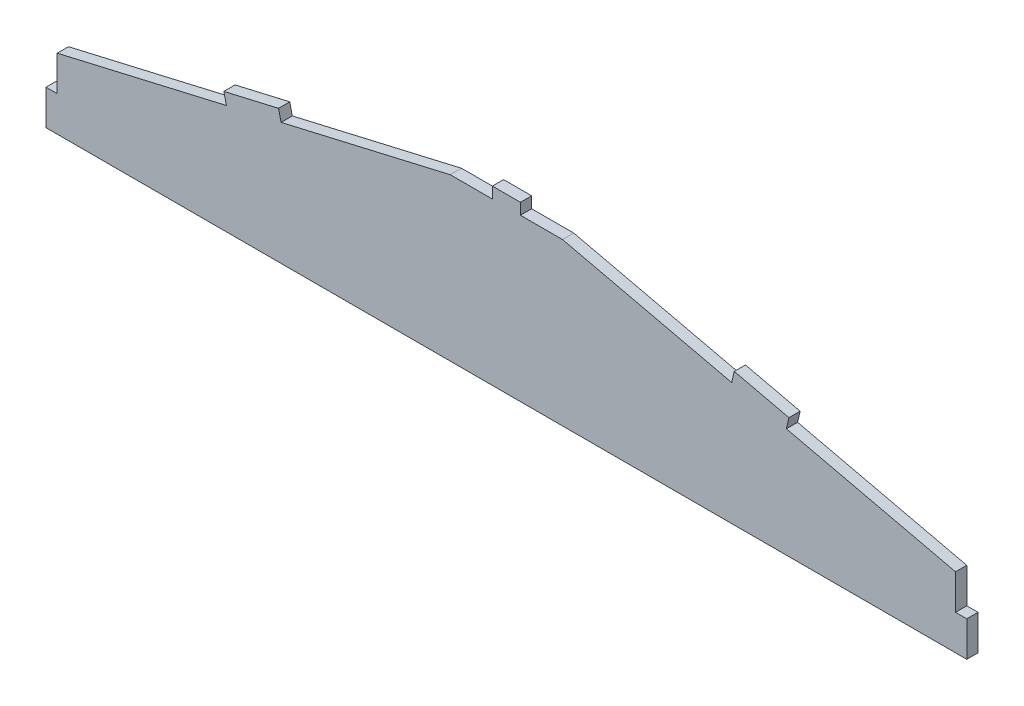
ISO-10303-21;
HEADER;
FILE_DESCRIPTION(('STEP AP214'),'2;1');
FILE_NAME('part.step','',(''),(''),'','','');
FILE_SCHEMA(('AUTOMOTIVE_DESIGN { 1 0 10303 214 1 1 1 1 }'));
ENDSEC;
DATA;
#1=APPLICATION_CONTEXT('core data for automotive mechanical design processes');
#2=APPLICATION_PROTOCOL_DEFINITION('international standard','automotive_design',2000,#1);
#3=PRODUCT_CONTEXT('',#1,'mechanical');
#4=PRODUCT('Part','Part','',(#3));
#5=PRODUCT_RELATED_PRODUCT_CATEGORY('part','',(#4));
#6=PRODUCT_DEFINITION_FORMATION('','',#4);
#7=PRODUCT_DEFINITION_CONTEXT('part definition',#1,'design');
#8=PRODUCT_DEFINITION('design','',#6,#7);
#9=PRODUCT_DEFINITION_SHAPE('','',#8);
#10=(LENGTH_UNIT() NAMED_UNIT(*) SI_UNIT(.MILLI.,.METRE.));
#11=(NAMED_UNIT(*) PLANE_ANGLE_UNIT() SI_UNIT($,.RADIAN.));
#12=(NAMED_UNIT(*) SI_UNIT($,.STERADIAN.) SOLID_ANGLE_UNIT());
#13=UNCERTAINTY_MEASURE_WITH_UNIT(LENGTH_MEASURE(1.E-05),#10,'distance_accuracy_value','');
#14=(GEOMETRIC_REPRESENTATION_CONTEXT(3) GLOBAL_UNCERTAINTY_ASSIGNED_CONTEXT((#13)) GLOBAL_UNIT_ASSIGNED_CONTEXT((#10,
#11,#12)) REPRESENTATION_CONTEXT('',''));
#15=CARTESIAN_POINT('',(0.,0.,0.));
#16=DIRECTION('',(0.,0.,1.));
#17=DIRECTION('',(1.,0.,0.));
#18=AXIS2_PLACEMENT_3D('',#15,#16,#17);
#19=CARTESIAN_POINT('',(203.2,31.75,5.08));
#20=DIRECTION('',(0.22612970719935,0.974097200243352,0.));
#21=DIRECTION('',(-0.974097200243352,0.22612970719935,0.));
#22=AXIS2_PLACEMENT_3D('',#19,#20,#21);
#23=PLANE('',#22);
#24=DIRECTION('',(0.,0.,1.));
#25=VECTOR('',#24,1.);
#26=CARTESIAN_POINT('',(126.671034443091,49.5156527185682,0.));
#27=LINE('',#26,#25);
#28=CARTESIAN_POINT('',(126.671034443091,49.5156527185682,0.));
#29=VERTEX_POINT('',#28);
#30=CARTESIAN_POINT('',(126.671034443091,49.5156527185682,5.08));
#31=VERTEX_POINT('',#30);
#32=EDGE_CURVE('E206',#29,#31,#27,.T.);
#33=ORIENTED_EDGE('',*,*,#32,.T.);
#34=DIRECTION('',(0.974097200243352,-0.22612970719935,0.));
#35=VECTOR('',#34,1.);
#36=CARTESIAN_POINT('',(203.2,31.75,5.08));
#37=LINE('',#36,#35);
#38=CARTESIAN_POINT('',(203.2,31.75,5.08));
#39=VERTEX_POINT('',#38);
#40=EDGE_CURVE('E316',#31,#39,#37,.T.);
#41=ORIENTED_EDGE('',*,*,#40,.T.);
#42=DIRECTION('',(0.,0.,-1.));
#43=VECTOR('',#42,1.);
#44=CARTESIAN_POINT('',(203.2,31.75,5.08));
#45=LINE('',#44,#43);
#46=CARTESIAN_POINT('',(203.2,31.75,0.));
#47=VERTEX_POINT('',#46);
#48=EDGE_CURVE('E325',#39,#47,#45,.T.);
#49=ORIENTED_EDGE('',*,*,#48,.T.);
#50=DIRECTION('',(0.974097200243352,-0.22612970719935,0.));
#51=VECTOR('',#50,1.);
#52=CARTESIAN_POINT('',(203.2,31.75,0.));
#53=LINE('',#52,#51);
#54=EDGE_CURVE('E56',#29,#47,#53,.T.);
#55=ORIENTED_EDGE('',*,*,#54,.F.);
#56=EDGE_LOOP('',(#33,#41,#49,#55));
#57=FACE_BOUND('',#56,.T.);
#58=ADVANCED_FACE('F33',(#57),#23,.T.);
#59=CARTESIAN_POINT('',(-25.4,73.025,5.08));
#60=DIRECTION('',(0.,-1.,0.));
#61=DIRECTION('',(0.,0.,-1.));
#62=AXIS2_PLACEMENT_3D('',#59,#60,#61);
#63=PLANE('',#62);
#64=DIRECTION('',(0.,0.,1.));
#65=VECTOR('',#64,1.);
#66=CARTESIAN_POINT('',(-6.35,73.025,0.));
#67=LINE('',#66,#65);
#68=CARTESIAN_POINT('',(-6.35,73.025,0.));
#69=VERTEX_POINT('',#68);
#70=CARTESIAN_POINT('',(-6.35,73.025,5.08));
#71=VERTEX_POINT('',#70);
#72=EDGE_CURVE('E250',#69,#71,#67,.T.);
#73=ORIENTED_EDGE('',*,*,#72,.F.);
#74=DIRECTION('',(-1.,0.,0.));
#75=VECTOR('',#74,1.);
#76=CARTESIAN_POINT('',(-25.4,73.025,0.));
#77=LINE('',#76,#75);
#78=CARTESIAN_POINT('',(-25.4,73.025,0.));
#79=VERTEX_POINT('',#78);
#80=EDGE_CURVE('E343',#69,#79,#77,.T.);
#81=ORIENTED_EDGE('',*,*,#80,.T.);
#82=DIRECTION('',(0.,0.,-1.));
#83=VECTOR('',#82,1.);
#84=CARTESIAN_POINT('',(-25.4,73.025,5.08));
#85=LINE('',#84,#83);
#86=CARTESIAN_POINT('',(-25.4,73.025,5.08));
#87=VERTEX_POINT('',#86);
#88=EDGE_CURVE('E11',#87,#79,#85,.T.);
#89=ORIENTED_EDGE('',*,*,#88,.F.);
#90=DIRECTION('',(-1.,0.,0.));
#91=VECTOR('',#90,1.);
#92=CARTESIAN_POINT('',(-25.4,73.025,5.08));
#93=LINE('',#92,#91);
#94=EDGE_CURVE('E330',#71,#87,#93,.T.);
#95=ORIENTED_EDGE('',*,*,#94,.F.);
#96=EDGE_LOOP('',(#73,#81,#89,#95));
#97=FACE_BOUND('',#96,.T.);
#98=ADVANCED_FACE('F390',(#97),#63,.F.);
#99=CARTESIAN_POINT('',(-203.2,31.75,5.08));
#100=DIRECTION('',(0.22612970719935,-0.974097200243352,0.));
#101=DIRECTION('',(0.974097200243352,0.22612970719935,0.));
#102=AXIS2_PLACEMENT_3D('',#99,#100,#101);
#103=PLANE('',#102);
#104=DIRECTION('',(-0.974097200243352,-0.22612970719935,0.));
#105=VECTOR('',#104,1.);
#106=CARTESIAN_POINT('',(-203.2,31.75,5.08));
#107=LINE('',#106,#105);
#108=CARTESIAN_POINT('',(-126.671034443091,49.5156527185683,5.08));
#109=VERTEX_POINT('',#108);
#110=CARTESIAN_POINT('',(-203.2,31.75,5.08));
#111=VERTEX_POINT('',#110);
#112=EDGE_CURVE('E335',#109,#111,#107,.T.);
#113=ORIENTED_EDGE('',*,*,#112,.F.);
#114=DIRECTION('',(0.,0.,1.));
#115=VECTOR('',#114,1.);
#116=CARTESIAN_POINT('',(-126.671034443091,49.5156527185683,0.));
#117=LINE('',#116,#115);
#118=CARTESIAN_POINT('',(-126.671034443091,49.5156527185683,0.));
#119=VERTEX_POINT('',#118);
#120=EDGE_CURVE('E297',#119,#109,#117,.T.);
#121=ORIENTED_EDGE('',*,*,#120,.F.);
#122=DIRECTION('',(-0.974097200243352,-0.22612970719935,0.));
#123=VECTOR('',#122,1.);
#124=CARTESIAN_POINT('',(-203.2,31.75,0.));
#125=LINE('',#124,#123);
#126=CARTESIAN_POINT('',(-203.2,31.75,0.));
#127=VERTEX_POINT('',#126);
#128=EDGE_CURVE('E347',#119,#127,#125,.T.);
#129=ORIENTED_EDGE('',*,*,#128,.T.);
#130=DIRECTION('',(0.,0.,-1.));
#131=VECTOR('',#130,1.);
#132=CARTESIAN_POINT('',(-203.2,31.75,5.08));
#133=LINE('',#132,#131);
#134=EDGE_CURVE('E41',#111,#127,#133,.T.);
#135=ORIENTED_EDGE('',*,*,#134,.F.);
#136=EDGE_LOOP('',(#113,#121,#129,#135));
#137=FACE_BOUND('',#136,.T.);
#138=ADVANCED_FACE('F368',(#137),#103,.F.);
#139=CARTESIAN_POINT('',(0.,0.,5.08));
#140=DIRECTION('',(0.,1.,0.));
#141=DIRECTION('',(-1.,0.,0.));
#142=AXIS2_PLACEMENT_3D('',#139,#140,#141);
#143=PLANE('',#142);
#144=DIRECTION('',(1.,0.,0.));
#145=VECTOR('',#144,1.);
#146=CARTESIAN_POINT('',(0.,0.,0.));
#147=LINE('',#146,#145);
#148=CARTESIAN_POINT('',(-208.28,0.,0.));
#149=VERTEX_POINT('',#148);
#150=CARTESIAN_POINT('',(208.28,0.,0.));
#151=VERTEX_POINT('',#150);
#152=EDGE_CURVE('E327',#149,#151,#147,.T.);
#153=ORIENTED_EDGE('',*,*,#152,.T.);
#154=DIRECTION('',(0.,0.,1.));
#155=VECTOR('',#154,1.);
#156=CARTESIAN_POINT('',(208.28,0.,0.));
#157=LINE('',#156,#155);
#158=CARTESIAN_POINT('',(208.28,0.,5.08));
#159=VERTEX_POINT('',#158);
#160=EDGE_CURVE('E228',#151,#159,#157,.T.);
#161=ORIENTED_EDGE('',*,*,#160,.T.);
#162=DIRECTION('',(1.,0.,0.));
#163=VECTOR('',#162,1.);
#164=CARTESIAN_POINT('',(0.,0.,5.08));
#165=LINE('',#164,#163);
#166=CARTESIAN_POINT('',(-208.28,0.,5.08));
#167=VERTEX_POINT('',#166);
#168=EDGE_CURVE('E328',#167,#159,#165,.T.);
#169=ORIENTED_EDGE('',*,*,#168,.F.);
#170=DIRECTION('',(0.,0.,1.));
#171=VECTOR('',#170,1.);
#172=CARTESIAN_POINT('',(-208.28,0.,0.));
#173=LINE('',#172,#171);
#174=EDGE_CURVE('E279',#149,#167,#173,.T.);
#175=ORIENTED_EDGE('',*,*,#174,.F.);
#176=EDGE_LOOP('',(#153,#161,#169,#175));
#177=FACE_BOUND('',#176,.T.);
#178=ADVANCED_FACE('F35',(#177),#143,.F.);
#179=CARTESIAN_POINT('',(25.4,73.025,0.));
#180=VERTEX_POINT('',#179);
#181=CARTESIAN_POINT('',(6.35,73.025,0.));
#182=VERTEX_POINT('',#181);
#183=EDGE_CURVE('E344',#180,#182,#77,.T.);
#184=ORIENTED_EDGE('',*,*,#183,.T.);
#185=DIRECTION('',(0.,0.,1.));
#186=VECTOR('',#185,1.);
#187=CARTESIAN_POINT('',(6.35,73.025,0.));
#188=LINE('',#187,#186);
#189=CARTESIAN_POINT('',(6.35,73.025,5.08));
#190=VERTEX_POINT('',#189);
#191=EDGE_CURVE('E263',#182,#190,#188,.T.);
#192=ORIENTED_EDGE('',*,*,#191,.T.);
#193=CARTESIAN_POINT('',(25.4,73.025,5.08));
#194=VERTEX_POINT('',#193);
#195=EDGE_CURVE('E332',#194,#190,#93,.T.);
#196=ORIENTED_EDGE('',*,*,#195,.F.);
#197=DIRECTION('',(0.,0.,-1.));
#198=VECTOR('',#197,1.);
#199=CARTESIAN_POINT('',(25.4,73.025,5.08));
#200=LINE('',#199,#198);
#201=EDGE_CURVE('E319',#194,#180,#200,.T.);
#202=ORIENTED_EDGE('',*,*,#201,.T.);
#203=EDGE_LOOP('',(#184,#192,#196,#202));
#204=FACE_BOUND('',#203,.T.);
#205=ADVANCED_FACE('F401',(#204),#63,.F.);
#206=CARTESIAN_POINT('',(-101.928965556909,55.2593472814317,0.));
#207=VERTEX_POINT('',#206);
#208=EDGE_CURVE('E348',#79,#207,#125,.T.);
#209=ORIENTED_EDGE('',*,*,#208,.T.);
#210=DIRECTION('',(0.,0.,1.));
#211=VECTOR('',#210,1.);
#212=CARTESIAN_POINT('',(-101.928965556909,55.2593472814317,0.));
#213=LINE('',#212,#211);
#214=CARTESIAN_POINT('',(-101.928965556909,55.2593472814317,5.08));
#215=VERTEX_POINT('',#214);
#216=EDGE_CURVE('E310',#207,#215,#213,.T.);
#217=ORIENTED_EDGE('',*,*,#216,.T.);
#218=EDGE_CURVE('E336',#87,#215,#107,.T.);
#219=ORIENTED_EDGE('',*,*,#218,.F.);
#220=ORIENTED_EDGE('',*,*,#88,.T.);
#221=EDGE_LOOP('',(#209,#217,#219,#220));
#222=FACE_BOUND('',#221,.T.);
#223=ADVANCED_FACE('F384',(#222),#103,.F.);
#224=CARTESIAN_POINT('',(-203.2,0.,5.08));
#225=DIRECTION('',(1.,0.,0.));
#226=DIRECTION('',(0.,0.,-1.));
#227=AXIS2_PLACEMENT_3D('',#224,#225,#226);
#228=PLANE('',#227);
#229=DIRECTION('',(0.,-1.,0.));
#230=VECTOR('',#229,1.);
#231=CARTESIAN_POINT('',(-203.2,0.,0.));
#232=LINE('',#231,#230);
#233=CARTESIAN_POINT('',(-203.2,15.875,0.));
#234=VERTEX_POINT('',#233);
#235=EDGE_CURVE('E331',#127,#234,#232,.T.);
#236=ORIENTED_EDGE('',*,*,#235,.T.);
#237=DIRECTION('',(0.,0.,1.));
#238=VECTOR('',#237,1.);
#239=CARTESIAN_POINT('',(-203.2,15.875,0.));
#240=LINE('',#239,#238);
#241=CARTESIAN_POINT('',(-203.2,15.875,5.08));
#242=VERTEX_POINT('',#241);
#243=EDGE_CURVE('E274',#234,#242,#240,.T.);
#244=ORIENTED_EDGE('',*,*,#243,.T.);
#245=DIRECTION('',(0.,-1.,0.));
#246=VECTOR('',#245,1.);
#247=CARTESIAN_POINT('',(-203.2,0.,5.08));
#248=LINE('',#247,#246);
#249=EDGE_CURVE('E339',#111,#242,#248,.T.);
#250=ORIENTED_EDGE('',*,*,#249,.F.);
#251=ORIENTED_EDGE('',*,*,#134,.T.);
#252=EDGE_LOOP('',(#236,#244,#250,#251));
#253=FACE_BOUND('',#252,.T.);
#254=ADVANCED_FACE('F356',(#253),#228,.F.);
#255=CARTESIAN_POINT('',(0.,0.,5.08));
#256=DIRECTION('',(0.,0.,-1.));
#257=DIRECTION('',(-1.,0.,0.));
#258=AXIS2_PLACEMENT_3D('',#255,#256,#257);
#259=PLANE('',#258);
#260=ORIENTED_EDGE('',*,*,#168,.T.);
#261=DIRECTION('',(0.,1.,0.));
#262=VECTOR('',#261,1.);
#263=CARTESIAN_POINT('',(208.28,0.,5.08));
#264=LINE('',#263,#262);
#265=CARTESIAN_POINT('',(208.28,15.875,5.08));
#266=VERTEX_POINT('',#265);
#267=EDGE_CURVE('E217',#159,#266,#264,.T.);
#268=ORIENTED_EDGE('',*,*,#267,.T.);
#269=DIRECTION('',(-1.,0.,0.));
#270=VECTOR('',#269,1.);
#271=CARTESIAN_POINT('',(203.2,15.875,5.08));
#272=LINE('',#271,#270);
#273=CARTESIAN_POINT('',(203.2,15.875,5.08));
#274=VERTEX_POINT('',#273);
#275=EDGE_CURVE('E225',#266,#274,#272,.T.);
#276=ORIENTED_EDGE('',*,*,#275,.T.);
#277=DIRECTION('',(0.,-1.,0.));
#278=VECTOR('',#277,1.);
#279=CARTESIAN_POINT('',(203.2,0.,5.08));
#280=LINE('',#279,#278);
#281=EDGE_CURVE('E314',#39,#274,#280,.T.);
#282=ORIENTED_EDGE('',*,*,#281,.F.);
#283=ORIENTED_EDGE('',*,*,#40,.F.);
#284=DIRECTION('',(0.226129707199344,0.974097200243353,0.));
#285=VECTOR('',#284,1.);
#286=CARTESIAN_POINT('',(126.671034443091,49.5156527185682,5.08));
#287=LINE('',#286,#285);
#288=CARTESIAN_POINT('',(127.819773355663,54.4640664958045,5.08));
#289=VERTEX_POINT('',#288);
#290=EDGE_CURVE('E213',#31,#289,#287,.T.);
#291=ORIENTED_EDGE('',*,*,#290,.T.);
#292=DIRECTION('',(-0.974097200243352,0.22612970719935,0.));
#293=VECTOR('',#292,1.);
#294=CARTESIAN_POINT('',(127.819773355663,54.4640664958045,5.08));
#295=LINE('',#294,#293);
#296=CARTESIAN_POINT('',(103.077704469482,60.2077610586679,5.08));
#297=VERTEX_POINT('',#296);
#298=EDGE_CURVE('E189',#289,#297,#295,.T.);
#299=ORIENTED_EDGE('',*,*,#298,.T.);
#300=DIRECTION('',(-0.226129707199352,-0.974097200243351,0.));
#301=VECTOR('',#300,1.);
#302=CARTESIAN_POINT('',(101.928965556909,55.2593472814317,5.08));
#303=LINE('',#302,#301);
#304=CARTESIAN_POINT('',(101.928965556909,55.2593472814317,5.08));
#305=VERTEX_POINT('',#304);
#306=EDGE_CURVE('E207',#297,#305,#303,.T.);
#307=ORIENTED_EDGE('',*,*,#306,.T.);
#308=EDGE_CURVE('E48',#194,#305,#37,.T.);
#309=ORIENTED_EDGE('',*,*,#308,.F.);
#310=ORIENTED_EDGE('',*,*,#195,.T.);
#311=DIRECTION('',(0.,1.,0.));
#312=VECTOR('',#311,1.);
#313=CARTESIAN_POINT('',(6.35,73.025,5.08));
#314=LINE('',#313,#312);
#315=CARTESIAN_POINT('',(6.35,78.105,5.08));
#316=VERTEX_POINT('',#315);
#317=EDGE_CURVE('E253',#190,#316,#314,.T.);
#318=ORIENTED_EDGE('',*,*,#317,.T.);
#319=DIRECTION('',(-1.,0.,0.));
#320=VECTOR('',#319,1.);
#321=CARTESIAN_POINT('',(-6.35,78.105,5.08));
#322=LINE('',#321,#320);
#323=CARTESIAN_POINT('',(-6.35,78.105,5.08));
#324=VERTEX_POINT('',#323);
#325=EDGE_CURVE('E244',#316,#324,#322,.T.);
#326=ORIENTED_EDGE('',*,*,#325,.T.);
#327=DIRECTION('',(0.,-1.,0.));
#328=VECTOR('',#327,1.);
#329=CARTESIAN_POINT('',(-6.35,73.025,5.08));
#330=LINE('',#329,#328);
#331=EDGE_CURVE('E236',#324,#71,#330,.T.);
#332=ORIENTED_EDGE('',*,*,#331,.T.);
#333=ORIENTED_EDGE('',*,*,#94,.T.);
#334=ORIENTED_EDGE('',*,*,#218,.T.);
#335=DIRECTION('',(-0.226129707199347,0.974097200243352,0.));
#336=VECTOR('',#335,1.);
#337=CARTESIAN_POINT('',(-101.928965556909,55.2593472814317,5.08));
#338=LINE('',#337,#336);
#339=CARTESIAN_POINT('',(-103.077704469482,60.207761058668,5.08));
#340=VERTEX_POINT('',#339);
#341=EDGE_CURVE('E300',#215,#340,#338,.T.);
#342=ORIENTED_EDGE('',*,*,#341,.T.);
#343=DIRECTION('',(-0.974097200243352,-0.22612970719935,0.));
#344=VECTOR('',#343,1.);
#345=CARTESIAN_POINT('',(-127.819773355663,54.4640664958045,5.08));
#346=LINE('',#345,#344);
#347=CARTESIAN_POINT('',(-127.819773355663,54.4640664958045,5.08));
#348=VERTEX_POINT('',#347);
#349=EDGE_CURVE('E291',#340,#348,#346,.T.);
#350=ORIENTED_EDGE('',*,*,#349,.T.);
#351=DIRECTION('',(0.226129707199355,-0.97409720024335,0.));
#352=VECTOR('',#351,1.);
#353=CARTESIAN_POINT('',(-126.671034443091,49.5156527185683,5.08));
#354=LINE('',#353,#352);
#355=EDGE_CURVE('E282',#348,#109,#354,.T.);
#356=ORIENTED_EDGE('',*,*,#355,.T.);
#357=ORIENTED_EDGE('',*,*,#112,.T.);
#358=ORIENTED_EDGE('',*,*,#249,.T.);
#359=DIRECTION('',(-1.,0.,0.));
#360=VECTOR('',#359,1.);
#361=CARTESIAN_POINT('',(-203.2,15.875,5.08));
#362=LINE('',#361,#360);
#363=CARTESIAN_POINT('',(-208.28,15.875,5.08));
#364=VERTEX_POINT('',#363);
#365=EDGE_CURVE('E260',#242,#364,#362,.T.);
#366=ORIENTED_EDGE('',*,*,#365,.T.);
#367=DIRECTION('',(0.,-1.,0.));
#368=VECTOR('',#367,1.);
#369=CARTESIAN_POINT('',(-208.28,0.,5.08));
#370=LINE('',#369,#368);
#371=EDGE_CURVE('E271',#364,#167,#370,.T.);
#372=ORIENTED_EDGE('',*,*,#371,.T.);
#373=EDGE_LOOP('',(#260,#268,#276,#282,#283,#291,#299,#307,#309,#310,#318,#326,#332,#333,#334,
#342,#350,#356,#357,#358,#366,#372));
#374=FACE_BOUND('',#373,.T.);
#375=ADVANCED_FACE('F365',(#374),#259,.F.);
#376=CARTESIAN_POINT('',(0.,0.,0.));
#377=DIRECTION('',(0.,0.,-1.));
#378=DIRECTION('',(-1.,0.,0.));
#379=AXIS2_PLACEMENT_3D('',#376,#377,#378);
#380=PLANE('',#379);
#381=ORIENTED_EDGE('',*,*,#152,.F.);
#382=DIRECTION('',(0.,-1.,0.));
#383=VECTOR('',#382,1.);
#384=CARTESIAN_POINT('',(-208.28,0.,0.));
#385=LINE('',#384,#383);
#386=CARTESIAN_POINT('',(-208.28,15.875,0.));
#387=VERTEX_POINT('',#386);
#388=EDGE_CURVE('E270',#387,#149,#385,.T.);
#389=ORIENTED_EDGE('',*,*,#388,.F.);
#390=DIRECTION('',(-1.,0.,0.));
#391=VECTOR('',#390,1.);
#392=CARTESIAN_POINT('',(-203.2,15.875,0.));
#393=LINE('',#392,#391);
#394=EDGE_CURVE('E267',#234,#387,#393,.T.);
#395=ORIENTED_EDGE('',*,*,#394,.F.);
#396=ORIENTED_EDGE('',*,*,#235,.F.);
#397=ORIENTED_EDGE('',*,*,#128,.F.);
#398=DIRECTION('',(0.226129707199355,-0.97409720024335,0.));
#399=VECTOR('',#398,1.);
#400=CARTESIAN_POINT('',(-126.671034443091,49.5156527185683,0.));
#401=LINE('',#400,#399);
#402=CARTESIAN_POINT('',(-127.819773355663,54.4640664958045,0.));
#403=VERTEX_POINT('',#402);
#404=EDGE_CURVE('E287',#403,#119,#401,.T.);
#405=ORIENTED_EDGE('',*,*,#404,.F.);
#406=DIRECTION('',(-0.974097200243352,-0.22612970719935,0.));
#407=VECTOR('',#406,1.);
#408=CARTESIAN_POINT('',(-127.819773355663,54.4640664958045,0.));
#409=LINE('',#408,#407);
#410=CARTESIAN_POINT('',(-103.077704469482,60.207761058668,0.));
#411=VERTEX_POINT('',#410);
#412=EDGE_CURVE('E294',#411,#403,#409,.T.);
#413=ORIENTED_EDGE('',*,*,#412,.F.);
#414=DIRECTION('',(-0.226129707199347,0.974097200243352,0.));
#415=VECTOR('',#414,1.);
#416=CARTESIAN_POINT('',(-101.928965556909,55.2593472814317,0.));
#417=LINE('',#416,#415);
#418=EDGE_CURVE('E290',#207,#411,#417,.T.);
#419=ORIENTED_EDGE('',*,*,#418,.F.);
#420=ORIENTED_EDGE('',*,*,#208,.F.);
#421=ORIENTED_EDGE('',*,*,#80,.F.);
#422=DIRECTION('',(0.,-1.,0.));
#423=VECTOR('',#422,1.);
#424=CARTESIAN_POINT('',(-6.35,73.025,0.));
#425=LINE('',#424,#423);
#426=CARTESIAN_POINT('',(-6.35,78.105,0.));
#427=VERTEX_POINT('',#426);
#428=EDGE_CURVE('E241',#427,#69,#425,.T.);
#429=ORIENTED_EDGE('',*,*,#428,.F.);
#430=DIRECTION('',(-1.,0.,0.));
#431=VECTOR('',#430,1.);
#432=CARTESIAN_POINT('',(-6.35,78.105,0.));
#433=LINE('',#432,#431);
#434=CARTESIAN_POINT('',(6.35,78.105,0.));
#435=VERTEX_POINT('',#434);
#436=EDGE_CURVE('E247',#435,#427,#433,.T.);
#437=ORIENTED_EDGE('',*,*,#436,.F.);
#438=DIRECTION('',(0.,1.,0.));
#439=VECTOR('',#438,1.);
#440=CARTESIAN_POINT('',(6.35,73.025,0.));
#441=LINE('',#440,#439);
#442=EDGE_CURVE('E243',#182,#435,#441,.T.);
#443=ORIENTED_EDGE('',*,*,#442,.F.);
#444=ORIENTED_EDGE('',*,*,#183,.F.);
#445=CARTESIAN_POINT('',(101.928965556909,55.2593472814317,0.));
#446=VERTEX_POINT('',#445);
#447=EDGE_CURVE('E317',#180,#446,#53,.T.);
#448=ORIENTED_EDGE('',*,*,#447,.T.);
#449=DIRECTION('',(-0.226129707199352,-0.974097200243351,0.));
#450=VECTOR('',#449,1.);
#451=CARTESIAN_POINT('',(101.928965556909,55.2593472814317,0.));
#452=LINE('',#451,#450);
#453=CARTESIAN_POINT('',(103.077704469482,60.2077610586679,0.));
#454=VERTEX_POINT('',#453);
#455=EDGE_CURVE('E195',#454,#446,#452,.T.);
#456=ORIENTED_EDGE('',*,*,#455,.F.);
#457=DIRECTION('',(-0.974097200243352,0.22612970719935,0.));
#458=VECTOR('',#457,1.);
#459=CARTESIAN_POINT('',(127.819773355663,54.4640664958045,0.));
#460=LINE('',#459,#458);
#461=CARTESIAN_POINT('',(127.819773355663,54.4640664958045,0.));
#462=VERTEX_POINT('',#461);
#463=EDGE_CURVE('E187',#462,#454,#460,.T.);
#464=ORIENTED_EDGE('',*,*,#463,.F.);
#465=DIRECTION('',(0.226129707199344,0.974097200243353,0.));
#466=VECTOR('',#465,1.);
#467=CARTESIAN_POINT('',(126.671034443091,49.5156527185682,0.));
#468=LINE('',#467,#466);
#469=EDGE_CURVE('E201',#29,#462,#468,.T.);
#470=ORIENTED_EDGE('',*,*,#469,.F.);
#471=ORIENTED_EDGE('',*,*,#54,.T.);
#472=DIRECTION('',(0.,-1.,0.));
#473=VECTOR('',#472,1.);
#474=CARTESIAN_POINT('',(203.2,0.,0.));
#475=LINE('',#474,#473);
#476=CARTESIAN_POINT('',(203.2,15.875,0.));
#477=VERTEX_POINT('',#476);
#478=EDGE_CURVE('E307',#47,#477,#475,.T.);
#479=ORIENTED_EDGE('',*,*,#478,.T.);
#480=DIRECTION('',(-1.,0.,0.));
#481=VECTOR('',#480,1.);
#482=CARTESIAN_POINT('',(203.2,15.875,0.));
#483=LINE('',#482,#481);
#484=CARTESIAN_POINT('',(208.28,15.875,0.));
#485=VERTEX_POINT('',#484);
#486=EDGE_CURVE('E224',#485,#477,#483,.T.);
#487=ORIENTED_EDGE('',*,*,#486,.F.);
#488=DIRECTION('',(0.,1.,0.));
#489=VECTOR('',#488,1.);
#490=CARTESIAN_POINT('',(208.28,0.,0.));
#491=LINE('',#490,#489);
#492=EDGE_CURVE('E221',#151,#485,#491,.T.);
#493=ORIENTED_EDGE('',*,*,#492,.F.);
#494=EDGE_LOOP('',(#381,#389,#395,#396,#397,#405,#413,#419,#420,#421,#429,#437,#443,#444,#448,
#456,#464,#470,#471,#479,#487,#493));
#495=FACE_BOUND('',#494,.T.);
#496=ADVANCED_FACE('F200',(#495),#380,.T.);
#497=CARTESIAN_POINT('',(203.2,0.,5.08));
#498=DIRECTION('',(1.,0.,0.));
#499=DIRECTION('',(0.,1.,0.));
#500=AXIS2_PLACEMENT_3D('',#497,#498,#499);
#501=PLANE('',#500);
#502=DIRECTION('',(0.,0.,1.));
#503=VECTOR('',#502,1.);
#504=CARTESIAN_POINT('',(203.2,15.875,0.));
#505=LINE('',#504,#503);
#506=EDGE_CURVE('E233',#477,#274,#505,.T.);
#507=ORIENTED_EDGE('',*,*,#506,.F.);
#508=ORIENTED_EDGE('',*,*,#478,.F.);
#509=ORIENTED_EDGE('',*,*,#48,.F.);
#510=ORIENTED_EDGE('',*,*,#281,.T.);
#511=EDGE_LOOP('',(#507,#508,#509,#510));
#512=FACE_BOUND('',#511,.T.);
#513=ADVANCED_FACE('F417',(#512),#501,.T.);
#514=DIRECTION('',(0.,0.,1.));
#515=VECTOR('',#514,1.);
#516=CARTESIAN_POINT('',(101.928965556909,55.2593472814317,0.));
#517=LINE('',#516,#515);
#518=EDGE_CURVE('E218',#446,#305,#517,.T.);
#519=ORIENTED_EDGE('',*,*,#518,.F.);
#520=ORIENTED_EDGE('',*,*,#447,.F.);
#521=ORIENTED_EDGE('',*,*,#201,.F.);
#522=ORIENTED_EDGE('',*,*,#308,.T.);
#523=EDGE_LOOP('',(#519,#520,#521,#522));
#524=FACE_BOUND('',#523,.T.);
#525=ADVANCED_FACE('F403',(#524),#23,.T.);
#526=CARTESIAN_POINT('',(-126.671034443091,49.5156527185683,0.));
#527=DIRECTION('',(-0.97409720024335,-0.226129707199355,0.));
#528=DIRECTION('',(0.226129707199355,-0.974097200243351,0.));
#529=AXIS2_PLACEMENT_3D('',#526,#527,#528);
#530=PLANE('',#529);
#531=ORIENTED_EDGE('',*,*,#355,.F.);
#532=DIRECTION('',(0.,0.,1.));
#533=VECTOR('',#532,1.);
#534=CARTESIAN_POINT('',(-127.819773355663,54.4640664958045,0.));
#535=LINE('',#534,#533);
#536=EDGE_CURVE('E305',#403,#348,#535,.T.);
#537=ORIENTED_EDGE('',*,*,#536,.F.);
#538=ORIENTED_EDGE('',*,*,#404,.T.);
#539=ORIENTED_EDGE('',*,*,#120,.T.);
#540=EDGE_LOOP('',(#531,#537,#538,#539));
#541=FACE_BOUND('',#540,.T.);
#542=ADVANCED_FACE('F370',(#541),#530,.T.);
#543=CARTESIAN_POINT('',(-127.819773355663,54.4640664958045,0.));
#544=DIRECTION('',(-0.22612970719935,0.974097200243352,0.));
#545=DIRECTION('',(-0.974097200243352,-0.22612970719935,0.));
#546=AXIS2_PLACEMENT_3D('',#543,#544,#545);
#547=PLANE('',#546);
#548=ORIENTED_EDGE('',*,*,#349,.F.);
#549=DIRECTION('',(0.,0.,1.));
#550=VECTOR('',#549,1.);
#551=CARTESIAN_POINT('',(-103.077704469482,60.207761058668,0.));
#552=LINE('',#551,#550);
#553=EDGE_CURVE('E308',#411,#340,#552,.T.);
#554=ORIENTED_EDGE('',*,*,#553,.F.);
#555=ORIENTED_EDGE('',*,*,#412,.T.);
#556=ORIENTED_EDGE('',*,*,#536,.T.);
#557=EDGE_LOOP('',(#548,#554,#555,#556));
#558=FACE_BOUND('',#557,.T.);
#559=ADVANCED_FACE('F375',(#558),#547,.T.);
#560=CARTESIAN_POINT('',(-101.928965556909,55.2593472814317,0.));
#561=DIRECTION('',(0.974097200243352,0.226129707199347,0.));
#562=DIRECTION('',(-0.226129707199347,0.974097200243352,0.));
#563=AXIS2_PLACEMENT_3D('',#560,#561,#562);
#564=PLANE('',#563);
#565=ORIENTED_EDGE('',*,*,#341,.F.);
#566=ORIENTED_EDGE('',*,*,#216,.F.);
#567=ORIENTED_EDGE('',*,*,#418,.T.);
#568=ORIENTED_EDGE('',*,*,#553,.T.);
#569=EDGE_LOOP('',(#565,#566,#567,#568));
#570=FACE_BOUND('',#569,.T.);
#571=ADVANCED_FACE('F379',(#570),#564,.T.);
#572=CARTESIAN_POINT('',(-208.28,0.,0.));
#573=DIRECTION('',(-1.,0.,0.));
#574=DIRECTION('',(0.,0.,1.));
#575=AXIS2_PLACEMENT_3D('',#572,#573,#574);
#576=PLANE('',#575);
#577=ORIENTED_EDGE('',*,*,#371,.F.);
#578=DIRECTION('',(0.,0.,1.));
#579=VECTOR('',#578,1.);
#580=CARTESIAN_POINT('',(-208.28,15.875,0.));
#581=LINE('',#580,#579);
#582=EDGE_CURVE('E283',#387,#364,#581,.T.);
#583=ORIENTED_EDGE('',*,*,#582,.F.);
#584=ORIENTED_EDGE('',*,*,#388,.T.);
#585=ORIENTED_EDGE('',*,*,#174,.T.);
#586=EDGE_LOOP('',(#577,#583,#584,#585));
#587=FACE_BOUND('',#586,.T.);
#588=ADVANCED_FACE('F453',(#587),#576,.T.);
#589=CARTESIAN_POINT('',(-203.2,15.875,0.));
#590=DIRECTION('',(0.,1.,0.));
#591=DIRECTION('',(-1.,0.,0.));
#592=AXIS2_PLACEMENT_3D('',#589,#590,#591);
#593=PLANE('',#592);
#594=ORIENTED_EDGE('',*,*,#365,.F.);
#595=ORIENTED_EDGE('',*,*,#243,.F.);
#596=ORIENTED_EDGE('',*,*,#394,.T.);
#597=ORIENTED_EDGE('',*,*,#582,.T.);
#598=EDGE_LOOP('',(#594,#595,#596,#597));
#599=FACE_BOUND('',#598,.T.);
#600=ADVANCED_FACE('F363',(#599),#593,.T.);
#601=CARTESIAN_POINT('',(-6.35,73.025,0.));
#602=DIRECTION('',(-1.,0.,0.));
#603=DIRECTION('',(0.,-1.,0.));
#604=AXIS2_PLACEMENT_3D('',#601,#602,#603);
#605=PLANE('',#604);
#606=ORIENTED_EDGE('',*,*,#331,.F.);
#607=DIRECTION('',(0.,0.,1.));
#608=VECTOR('',#607,1.);
#609=CARTESIAN_POINT('',(-6.35,78.105,0.));
#610=LINE('',#609,#608);
#611=EDGE_CURVE('E258',#427,#324,#610,.T.);
#612=ORIENTED_EDGE('',*,*,#611,.F.);
#613=ORIENTED_EDGE('',*,*,#428,.T.);
#614=ORIENTED_EDGE('',*,*,#72,.T.);
#615=EDGE_LOOP('',(#606,#612,#613,#614));
#616=FACE_BOUND('',#615,.T.);
#617=ADVANCED_FACE('F393',(#616),#605,.T.);
#618=CARTESIAN_POINT('',(-6.35,78.105,0.));
#619=DIRECTION('',(0.,1.,0.));
#620=DIRECTION('',(0.,0.,1.));
#621=AXIS2_PLACEMENT_3D('',#618,#619,#620);
#622=PLANE('',#621);
#623=ORIENTED_EDGE('',*,*,#325,.F.);
#624=DIRECTION('',(0.,0.,1.));
#625=VECTOR('',#624,1.);
#626=CARTESIAN_POINT('',(6.35,78.105,0.));
#627=LINE('',#626,#625);
#628=EDGE_CURVE('E261',#435,#316,#627,.T.);
#629=ORIENTED_EDGE('',*,*,#628,.F.);
#630=ORIENTED_EDGE('',*,*,#436,.T.);
#631=ORIENTED_EDGE('',*,*,#611,.T.);
#632=EDGE_LOOP('',(#623,#629,#630,#631));
#633=FACE_BOUND('',#632,.T.);
#634=ADVANCED_FACE('F396',(#633),#622,.T.);
#635=CARTESIAN_POINT('',(6.35,73.025,0.));
#636=DIRECTION('',(1.,0.,0.));
#637=DIRECTION('',(0.,1.,0.));
#638=AXIS2_PLACEMENT_3D('',#635,#636,#637);
#639=PLANE('',#638);
#640=ORIENTED_EDGE('',*,*,#317,.F.);
#641=ORIENTED_EDGE('',*,*,#191,.F.);
#642=ORIENTED_EDGE('',*,*,#442,.T.);
#643=ORIENTED_EDGE('',*,*,#628,.T.);
#644=EDGE_LOOP('',(#640,#641,#642,#643));
#645=FACE_BOUND('',#644,.T.);
#646=ADVANCED_FACE('F500',(#645),#639,.T.);
#647=CARTESIAN_POINT('',(203.2,15.875,0.));
#648=DIRECTION('',(0.,1.,0.));
#649=DIRECTION('',(-1.,0.,0.));
#650=AXIS2_PLACEMENT_3D('',#647,#648,#649);
#651=PLANE('',#650);
#652=ORIENTED_EDGE('',*,*,#275,.F.);
#653=DIRECTION('',(0.,0.,1.));
#654=VECTOR('',#653,1.);
#655=CARTESIAN_POINT('',(208.28,15.875,0.));
#656=LINE('',#655,#654);
#657=EDGE_CURVE('E237',#485,#266,#656,.T.);
#658=ORIENTED_EDGE('',*,*,#657,.F.);
#659=ORIENTED_EDGE('',*,*,#486,.T.);
#660=ORIENTED_EDGE('',*,*,#506,.T.);
#661=EDGE_LOOP('',(#652,#658,#659,#660));
#662=FACE_BOUND('',#661,.T.);
#663=ADVANCED_FACE('F451',(#662),#651,.T.);
#664=CARTESIAN_POINT('',(208.28,0.,0.));
#665=DIRECTION('',(1.,0.,0.));
#666=DIRECTION('',(0.,0.,-1.));
#667=AXIS2_PLACEMENT_3D('',#664,#665,#666);
#668=PLANE('',#667);
#669=ORIENTED_EDGE('',*,*,#267,.F.);
#670=ORIENTED_EDGE('',*,*,#160,.F.);
#671=ORIENTED_EDGE('',*,*,#492,.T.);
#672=ORIENTED_EDGE('',*,*,#657,.T.);
#673=EDGE_LOOP('',(#669,#670,#671,#672));
#674=FACE_BOUND('',#673,.T.);
#675=ADVANCED_FACE('F446',(#674),#668,.T.);
#676=CARTESIAN_POINT('',(126.671034443091,49.5156527185682,0.));
#677=DIRECTION('',(0.974097200243353,-0.226129707199344,0.));
#678=DIRECTION('',(0.226129707199344,0.974097200243353,0.));
#679=AXIS2_PLACEMENT_3D('',#676,#677,#678);
#680=PLANE('',#679);
#681=ORIENTED_EDGE('',*,*,#290,.F.);
#682=ORIENTED_EDGE('',*,*,#32,.F.);
#683=ORIENTED_EDGE('',*,*,#469,.T.);
#684=DIRECTION('',(0.,0.,1.));
#685=VECTOR('',#684,1.);
#686=CARTESIAN_POINT('',(127.819773355663,54.4640664958045,0.));
#687=LINE('',#686,#685);
#688=EDGE_CURVE('E184',#462,#289,#687,.T.);
#689=ORIENTED_EDGE('',*,*,#688,.T.);
#690=EDGE_LOOP('',(#681,#682,#683,#689));
#691=FACE_BOUND('',#690,.T.);
#692=ADVANCED_FACE('F205',(#691),#680,.T.);
#693=CARTESIAN_POINT('',(101.928965556909,55.2593472814317,0.));
#694=DIRECTION('',(-0.974097200243351,0.226129707199352,0.));
#695=DIRECTION('',(-0.226129707199352,-0.974097200243351,0.));
#696=AXIS2_PLACEMENT_3D('',#693,#694,#695);
#697=PLANE('',#696);
#698=ORIENTED_EDGE('',*,*,#306,.F.);
#699=DIRECTION('',(0.,0.,1.));
#700=VECTOR('',#699,1.);
#701=CARTESIAN_POINT('',(103.077704469482,60.2077610586679,0.));
#702=LINE('',#701,#700);
#703=EDGE_CURVE('E194',#454,#297,#702,.T.);
#704=ORIENTED_EDGE('',*,*,#703,.F.);
#705=ORIENTED_EDGE('',*,*,#455,.T.);
#706=ORIENTED_EDGE('',*,*,#518,.T.);
#707=EDGE_LOOP('',(#698,#704,#705,#706));
#708=FACE_BOUND('',#707,.T.);
#709=ADVANCED_FACE('F406',(#708),#697,.T.);
#710=CARTESIAN_POINT('',(127.819773355663,54.4640664958045,0.));
#711=DIRECTION('',(0.22612970719935,0.974097200243352,0.));
#712=DIRECTION('',(-0.974097200243352,0.22612970719935,0.));
#713=AXIS2_PLACEMENT_3D('',#710,#711,#712);
#714=PLANE('',#713);
#715=ORIENTED_EDGE('',*,*,#298,.F.);
#716=ORIENTED_EDGE('',*,*,#688,.F.);
#717=ORIENTED_EDGE('',*,*,#463,.T.);
#718=ORIENTED_EDGE('',*,*,#703,.T.);
#719=EDGE_LOOP('',(#715,#716,#717,#718));
#720=FACE_BOUND('',#719,.T.);
#721=ADVANCED_FACE('F186',(#720),#714,.T.);
#722=CLOSED_SHELL('',(#58,#98,#138,#178,#205,#223,#254,#375,#496,#513,#525,#542,#559,#571,#588,
#600,#617,#634,#646,#663,#675,#692,#709,#721));
#723=MANIFOLD_SOLID_BREP('B2',#722);
#724=ADVANCED_BREP_SHAPE_REPRESENTATION('',(#18,#723),#14);
#725=SHAPE_DEFINITION_REPRESENTATION(#9,#724);
ENDSEC;
END-ISO-10303-21;
